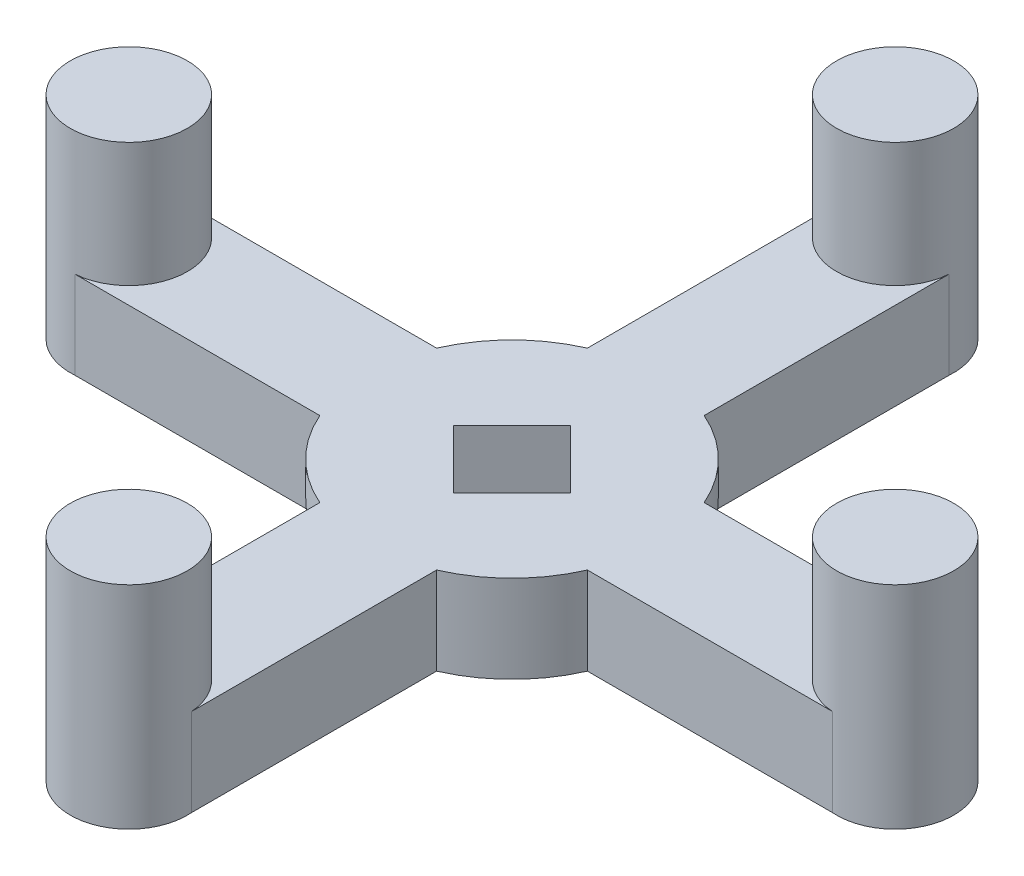
ISO-10303-21;
HEADER;
FILE_DESCRIPTION(('STEP AP214'),'2;1');
FILE_NAME('part.step','',(''),(''),'','','');
FILE_SCHEMA(('AUTOMOTIVE_DESIGN { 1 0 10303 214 1 1 1 1 }'));
ENDSEC;
DATA;
#1=APPLICATION_CONTEXT('core data for automotive mechanical design processes');
#2=APPLICATION_PROTOCOL_DEFINITION('international standard','automotive_design',2000,#1);
#3=PRODUCT_CONTEXT('',#1,'mechanical');
#4=PRODUCT('Part','Part','',(#3));
#5=PRODUCT_RELATED_PRODUCT_CATEGORY('part','',(#4));
#6=PRODUCT_DEFINITION_FORMATION('','',#4);
#7=PRODUCT_DEFINITION_CONTEXT('part definition',#1,'design');
#8=PRODUCT_DEFINITION('design','',#6,#7);
#9=PRODUCT_DEFINITION_SHAPE('','',#8);
#10=(LENGTH_UNIT() NAMED_UNIT(*) SI_UNIT(.MILLI.,.METRE.));
#11=(NAMED_UNIT(*) PLANE_ANGLE_UNIT() SI_UNIT($,.RADIAN.));
#12=(NAMED_UNIT(*) SI_UNIT($,.STERADIAN.) SOLID_ANGLE_UNIT());
#13=UNCERTAINTY_MEASURE_WITH_UNIT(LENGTH_MEASURE(1.E-05),#10,'distance_accuracy_value','');
#14=(GEOMETRIC_REPRESENTATION_CONTEXT(3) GLOBAL_UNCERTAINTY_ASSIGNED_CONTEXT((#13)) GLOBAL_UNIT_ASSIGNED_CONTEXT((#10,
#11,#12)) REPRESENTATION_CONTEXT('',''));
#15=CARTESIAN_POINT('',(0.,0.,0.));
#16=DIRECTION('',(0.,0.,1.));
#17=DIRECTION('',(1.,0.,0.));
#18=AXIS2_PLACEMENT_3D('',#15,#16,#17);
#19=CARTESIAN_POINT('',(-30.2617295595949,0.,30.261729559595));
#20=DIRECTION('',(0.707106781186547,0.,-0.707106781186548));
#21=DIRECTION('',(-0.707106781186548,0.,-0.707106781186547));
#22=AXIS2_PLACEMENT_3D('',#19,#20,#21);
#23=CYLINDRICAL_SURFACE('',#22,1.05);
#24=CARTESIAN_POINT('',(-2.00005153058616,0.,2.00005153058615));
#25=DIRECTION('',(-0.707106781186551,0.,0.707106781186544));
#26=DIRECTION('',(0.707106781186544,0.,0.707106781186551));
#27=AXIS2_PLACEMENT_3D('',#24,#25,#26);
#28=CIRCLE('',#27,1.05);
#29=CARTESIAN_POINT('',(-1.25758941034029,0.,2.74251365083203));
#30=VERTEX_POINT('',#29);
#31=EDGE_CURVE('E164',#30,#30,#28,.F.);
#32=ORIENTED_EDGE('',*,*,#31,.T.);
#33=EDGE_LOOP('',(#32));
#34=FACE_BOUND('',#33,.T.);
#35=CARTESIAN_POINT('',(-7.77444263785257,0.,6.28951839736082));
#36=CARTESIAN_POINT('',(-7.7744413524949,0.0588042797988381,6.28952070320949));
#37=CARTESIAN_POINT('',(-7.77131060427181,0.117647053856749,6.29339600114819));
#38=CARTESIAN_POINT('',(-7.75883832687858,0.233700042419567,6.30876548813307));
#39=CARTESIAN_POINT('',(-7.74949001778663,0.29090840358077,6.32026799420556));
#40=CARTESIAN_POINT('',(-7.72476692201935,0.401995206222953,6.35046095734337));
#41=CARTESIAN_POINT('',(-7.70939586833665,0.45587568647583,6.36914696182735));
#42=CARTESIAN_POINT('',(-7.67293150099148,0.558818620858889,6.41302831098017));
#43=CARTESIAN_POINT('',(-7.65183929481719,0.607882004971089,6.43822239578411));
#44=CARTESIAN_POINT('',(-7.60426843265572,0.700005301180209,6.49434026583252));
#45=CARTESIAN_POINT('',(-7.57777089534291,0.7430432520097,6.52528410076258));
#46=CARTESIAN_POINT('',(-7.51999053110413,0.821704767158425,6.59178874010345));
#47=CARTESIAN_POINT('',(-7.48870748195267,0.857327986977329,6.62734975891146));
#48=CARTESIAN_POINT('',(-7.42197396455896,0.92022535491958,6.70200051768648));
#49=CARTESIAN_POINT('',(-7.38651401074842,0.947479972078869,6.74109824078517));
#50=CARTESIAN_POINT('',(-7.31233413428337,0.992741502827463,6.82149233808943));
#51=CARTESIAN_POINT('',(-7.27361429866437,1.01074866322335,6.862788653584));
#52=CARTESIAN_POINT('',(-7.19405843241905,1.03693945360646,6.94613765531224));
#53=CARTESIAN_POINT('',(-7.15323077908548,1.04515925388732,6.98818696998152));
#54=CARTESIAN_POINT('',(-7.07044375033903,1.05165394447468,7.07193688726315));
#55=CARTESIAN_POINT('',(-7.02848440707793,1.0499291170166,7.11363749973827));
#56=CARTESIAN_POINT('',(-6.94481171294699,1.03661280659589,7.19534553837829));
#57=CARTESIAN_POINT('',(-6.90309804417206,1.02506021859492,7.23535898746464));
#58=CARTESIAN_POINT('',(-6.82100013058422,0.99247695381716,7.31280685191605));
#59=CARTESIAN_POINT('',(-6.78061590455517,0.971446143183014,7.35024123084928));
#60=CARTESIAN_POINT('',(-6.70235585094182,0.920461009383729,7.42167376563218));
#61=CARTESIAN_POINT('',(-6.66448501443044,0.890489544046534,7.45566515088902));
#62=CARTESIAN_POINT('',(-6.59255339760426,0.822486331471132,7.51934511767296));
#63=CARTESIAN_POINT('',(-6.558492740612,0.784454323455863,7.54903355993762));
#64=CARTESIAN_POINT('',(-6.49515786090781,0.701191031075323,7.60359677451168));
#65=CARTESIAN_POINT('',(-6.46590752248891,0.65592589989252,7.62844763289442));
#66=CARTESIAN_POINT('',(-6.41340473073608,0.559598424337302,7.67264108284968));
#67=CARTESIAN_POINT('',(-6.39015228763259,0.508536070076924,7.69198366502689));
#68=CARTESIAN_POINT('',(-6.35047090181121,0.402036893214183,7.7247773678977));
#69=CARTESIAN_POINT('',(-6.33404362923858,0.346599003846314,7.73822704661923));
#70=CARTESIAN_POINT('',(-6.30862686086858,0.232935780615798,7.75896246903904));
#71=CARTESIAN_POINT('',(-6.29963711469647,0.174710540655529,7.76624842023146));
#72=CARTESIAN_POINT('',(-6.28945751956443,0.057422457182683,7.7744946856462));
#73=CARTESIAN_POINT('',(-6.28823070639442,-0.00163507280433432,7.77548497757072));
#74=CARTESIAN_POINT('',(-6.2935246359548,-0.119171980098777,7.77120060205943));
#75=CARTESIAN_POINT('',(-6.30004526305909,-0.177651366021537,7.76592602812315));
#76=CARTESIAN_POINT('',(-6.32056524649243,-0.292233290204495,7.74923398963824));
#77=CARTESIAN_POINT('',(-6.33454714797061,-0.348341047362894,7.73783086174169));
#78=CARTESIAN_POINT('',(-6.36946658816452,-0.45674943530397,7.70911171588037));
#79=CARTESIAN_POINT('',(-6.39040430197649,-0.509049970208356,7.69179554906843));
#80=CARTESIAN_POINT('',(-6.43858039930818,-0.608574758075075,7.65151411736756));
#81=CARTESIAN_POINT('',(-6.46584211695633,-0.655779238565999,7.6285279109229));
#82=CARTESIAN_POINT('',(-6.52567663847168,-0.743571223762096,7.577406471072));
#83=CARTESIAN_POINT('',(-6.55824958740715,-0.784158547669061,7.54927109702146));
#84=CARTESIAN_POINT('',(-6.62775089741038,-0.857727885414378,7.48832815337124));
#85=CARTESIAN_POINT('',(-6.66469608147575,-0.890678978632526,7.45550242930256));
#86=CARTESIAN_POINT('',(-6.74162364087402,-0.947827506723883,7.38601337951569));
#87=CARTESIAN_POINT('',(-6.78160597089742,-0.972025072155117,7.34935011104461));
#88=CARTESIAN_POINT('',(-6.86325434886092,-1.01092751437801,7.27315948466202));
#89=CARTESIAN_POINT('',(-6.90491694014335,-1.02565091906968,7.23363788607238));
#90=CARTESIAN_POINT('',(-6.98871980633584,-1.04524753160562,7.15270487215369));
#91=CARTESIAN_POINT('',(-7.03086006630537,-1.0501210466847,7.1112935158106));
#92=CARTESIAN_POINT('',(-7.11417679631512,-1.04987496317388,7.0279402764482));
#93=CARTESIAN_POINT('',(-7.1553569264872,-1.04480330559072,6.98600190213463));
#94=CARTESIAN_POINT('',(-7.23582330825925,-1.02491155583418,6.90262407206424));
#95=CARTESIAN_POINT('',(-7.27510955880731,-1.01009145824638,6.86118461658454));
#96=CARTESIAN_POINT('',(-7.35076196654905,-0.971137135914569,6.78007200159183));
#97=CARTESIAN_POINT('',(-7.38712861502157,-0.947004482171252,6.74039854541836));
#98=CARTESIAN_POINT('',(-7.45607069046568,-0.890115142024079,6.66405722045093));
#99=CARTESIAN_POINT('',(-7.48864612714241,-0.857358477697597,6.62738934396304));
#100=CARTESIAN_POINT('',(-7.54941396202652,-0.783971522019472,6.55808557486453));
#101=CARTESIAN_POINT('',(-7.57758539202058,-0.743305516068438,6.52546911438952));
#102=CARTESIAN_POINT('',(-7.6287676057711,-0.655325701716674,6.46555965584064));
#103=CARTESIAN_POINT('',(-7.65177715284184,-0.608010304659201,6.43826793367308));
#104=CARTESIAN_POINT('',(-7.69221391360084,-0.507929430287261,6.38990177906103));
#105=CARTESIAN_POINT('',(-7.70962545717051,-0.455149191581643,6.36884481193997));
#106=CARTESIAN_POINT('',(-7.73841714659912,-0.345776118684258,6.33383127343739));
#107=CARTESIAN_POINT('',(-7.74980405166929,-0.289187637789121,6.31986674555692));
#108=CARTESIAN_POINT('',(-7.76351730688003,-0.193569603323703,6.30300476187987));
#109=CARTESIAN_POINT('',(-7.76761028450322,-0.155149989320419,6.2979559817554));
#110=CARTESIAN_POINT('',(-7.77307336889279,-0.0778258699252754,6.29121204437081));
#111=CARTESIAN_POINT('',(-7.77444348860489,-0.0389213668396894,6.28951687116609));
#112=CARTESIAN_POINT('',(-7.77444263785257,0.,6.28951839736082));
#113=B_SPLINE_CURVE_WITH_KNOTS('',3,(#35,#36,#37,#38,#39,#40,#41,#42,#43,#44,#45,#46,#47,#48,
#49,#50,#51,#52,#53,#54,#55,#56,#57,#58,#59,#60,#61,#62,#63,#64,#65,#66,#67,#68,#69,#70,#71,#72,
#73,#74,#75,#76,#77,#78,#79,#80,#81,#82,#83,#84,#85,#86,#87,#88,#89,#90,#91,#92,#93,#94,#95,#96,
#97,#98,#99,#100,#101,#102,#103,#104,#105,#106,#107,#108,#109,#110,#111,#112),.UNSPECIFIED.,.T.,
.F.,(4,2,2,2,2,2,2,2,2,2,2,2,2,2,2,2,2,2,2,2,2,2,2,2,2,2,2,2,2,2,2,2,2,2,2,2,2,2,4),(0.,
0.1762706963785,0.352733922474548,0.529087946442197,0.705407856516878,0.882354552232955,
1.05930946734291,1.23667428145322,1.41403436160476,1.59073693283144,1.76743448914147,
1.94343597219078,2.11943994092054,2.29578356009889,2.4721328852693,2.64933298541188,
2.82653338779815,3.00377712629631,3.18101489786945,3.35740808978209,3.5337986491606,
3.70977835919644,3.8857624994441,4.06240661039893,4.23905554692919,4.4164077370964,
4.59375728196371,4.77075893511106,4.94775506719057,5.12390008127571,5.30004519319432,
5.47616060293431,5.65227556182515,5.82920504681592,6.00617687547238,6.18363986156144,
6.36090332246534,6.47757389609535,6.59424391501752),.UNSPECIFIED.);
#114=CARTESIAN_POINT('',(-7.77444263785257,0.,6.28951839736082));
#115=VERTEX_POINT('',#114);
#116=EDGE_CURVE('E336',#115,#115,#113,.T.);
#117=ORIENTED_EDGE('',*,*,#116,.F.);
#118=EDGE_LOOP('',(#117));
#119=FACE_BOUND('',#118,.T.);
#120=ADVANCED_FACE('F160',(#34,#119),#23,.F.);
#121=CARTESIAN_POINT('',(0.,3.,0.));
#122=DIRECTION('',(0.,-1.,0.));
#123=DIRECTION('',(0.,0.,-1.));
#124=AXIS2_PLACEMENT_3D('',#121,#122,#123);
#125=CYLINDRICAL_SURFACE('',#124,10.);
#126=CARTESIAN_POINT('',(0.,3.,0.));
#127=DIRECTION('',(0.,1.,0.));
#128=DIRECTION('',(0.,0.,1.));
#129=AXIS2_PLACEMENT_3D('',#126,#127,#128);
#130=CIRCLE('',#129,10.);
#131=CARTESIAN_POINT('',(-4.,3.,-9.16515138991168));
#132=VERTEX_POINT('',#131);
#133=CARTESIAN_POINT('',(-9.16515138991168,3.,-4.));
#134=VERTEX_POINT('',#133);
#135=EDGE_CURVE('E454',#132,#134,#130,.T.);
#136=ORIENTED_EDGE('',*,*,#135,.F.);
#137=DIRECTION('',(0.,1.,0.));
#138=VECTOR('',#137,1.);
#139=CARTESIAN_POINT('',(-4.,-3.,-9.16515138991168));
#140=LINE('',#139,#138);
#141=CARTESIAN_POINT('',(-4.,-3.,-9.16515138991168));
#142=VERTEX_POINT('',#141);
#143=EDGE_CURVE('E12',#142,#132,#140,.T.);
#144=ORIENTED_EDGE('',*,*,#143,.F.);
#145=CARTESIAN_POINT('',(0.,-3.,0.));
#146=DIRECTION('',(0.,1.,0.));
#147=DIRECTION('',(0.,0.,1.));
#148=AXIS2_PLACEMENT_3D('',#145,#146,#147);
#149=CIRCLE('',#148,10.);
#150=CARTESIAN_POINT('',(-9.16515138991168,-3.,-4.));
#151=VERTEX_POINT('',#150);
#152=EDGE_CURVE('E429',#142,#151,#149,.T.);
#153=ORIENTED_EDGE('',*,*,#152,.T.);
#154=DIRECTION('',(0.,-1.,0.));
#155=VECTOR('',#154,1.);
#156=CARTESIAN_POINT('',(-9.16515138991168,3.,-4.));
#157=LINE('',#156,#155);
#158=EDGE_CURVE('E489',#134,#151,#157,.T.);
#159=ORIENTED_EDGE('',*,*,#158,.F.);
#160=EDGE_LOOP('',(#136,#144,#153,#159));
#161=FACE_BOUND('',#160,.T.);
#162=ADVANCED_FACE('F384',(#161),#125,.T.);
#163=CARTESIAN_POINT('',(0.,3.,0.));
#164=DIRECTION('',(0.,1.,0.));
#165=DIRECTION('',(0.,0.,1.));
#166=AXIS2_PLACEMENT_3D('',#163,#164,#165);
#167=PLANE('',#166);
#168=DIRECTION('',(0.707106781186544,0.,0.707106781186551));
#169=VECTOR('',#168,1.);
#170=CARTESIAN_POINT('',(-2.00005153058616,3.,2.00005153058614));
#171=LINE('',#170,#169);
#172=CARTESIAN_POINT('',(-4.0001030611723,3.,0.));
#173=VERTEX_POINT('',#172);
#174=CARTESIAN_POINT('',(0.,3.,4.0001030611723));
#175=VERTEX_POINT('',#174);
#176=EDGE_CURVE('E305',#173,#175,#171,.T.);
#177=ORIENTED_EDGE('',*,*,#176,.F.);
#178=DIRECTION('',(-0.707106781186552,0.,0.707106781186543));
#179=VECTOR('',#178,1.);
#180=CARTESIAN_POINT('',(-2.00005153058614,3.,-2.00005153058616));
#181=LINE('',#180,#179);
#182=CARTESIAN_POINT('',(0.,3.,-4.0001030611723));
#183=VERTEX_POINT('',#182);
#184=EDGE_CURVE('E334',#183,#173,#181,.T.);
#185=ORIENTED_EDGE('',*,*,#184,.F.);
#186=DIRECTION('',(-0.707106781186544,0.,-0.707106781186551));
#187=VECTOR('',#186,1.);
#188=CARTESIAN_POINT('',(2.00005153058616,3.,-2.00005153058614));
#189=LINE('',#188,#187);
#190=CARTESIAN_POINT('',(4.0001030611723,3.,0.));
#191=VERTEX_POINT('',#190);
#192=EDGE_CURVE('E329',#191,#183,#189,.T.);
#193=ORIENTED_EDGE('',*,*,#192,.F.);
#194=DIRECTION('',(0.707106781186551,0.,-0.707106781186544));
#195=VECTOR('',#194,1.);
#196=CARTESIAN_POINT('',(2.00005153058614,3.,2.00005153058616));
#197=LINE('',#196,#195);
#198=EDGE_CURVE('E332',#175,#191,#197,.T.);
#199=ORIENTED_EDGE('',*,*,#198,.F.);
#200=EDGE_LOOP('',(#177,#185,#193,#199));
#201=FACE_BOUND('',#200,.T.);
#202=CARTESIAN_POINT('',(26.25,3.,-2.73346806510016E-13));
#203=DIRECTION('',(0.,1.,0.));
#204=DIRECTION('',(0.,0.,1.));
#205=AXIS2_PLACEMENT_3D('',#202,#203,#204);
#206=CIRCLE('',#205,4.01172955959494);
#207=CARTESIAN_POINT('',(25.9434481131521,3.,-4.));
#208=VERTEX_POINT('',#207);
#209=CARTESIAN_POINT('',(25.9434481131557,3.,3.99999999999972));
#210=VERTEX_POINT('',#209);
#211=EDGE_CURVE('E581',#208,#210,#206,.T.);
#212=ORIENTED_EDGE('',*,*,#211,.F.);
#213=DIRECTION('',(-1.,0.,0.));
#214=VECTOR('',#213,1.);
#215=CARTESIAN_POINT('',(0.,3.,-4.));
#216=LINE('',#215,#214);
#217=CARTESIAN_POINT('',(9.16515138991168,3.,-4.));
#218=VERTEX_POINT('',#217);
#219=EDGE_CURVE('E457',#208,#218,#216,.T.);
#220=ORIENTED_EDGE('',*,*,#219,.T.);
#221=CARTESIAN_POINT('',(4.,3.,-9.16515138991168));
#222=VERTEX_POINT('',#221);
#223=EDGE_CURVE('E450',#218,#222,#130,.T.);
#224=ORIENTED_EDGE('',*,*,#223,.T.);
#225=DIRECTION('',(0.,0.,-1.));
#226=VECTOR('',#225,1.);
#227=CARTESIAN_POINT('',(4.,3.,0.));
#228=LINE('',#227,#226);
#229=CARTESIAN_POINT('',(4.,3.,-25.9434481131557));
#230=VERTEX_POINT('',#229);
#231=EDGE_CURVE('E492',#222,#230,#228,.T.);
#232=ORIENTED_EDGE('',*,*,#231,.T.);
#233=CARTESIAN_POINT('',(0.,3.,-26.25));
#234=DIRECTION('',(0.,1.,0.));
#235=DIRECTION('',(0.,0.,1.));
#236=AXIS2_PLACEMENT_3D('',#233,#234,#235);
#237=CIRCLE('',#236,4.01172955959494);
#238=CARTESIAN_POINT('',(-3.99999999999999,3.,-25.9434481131557));
#239=VERTEX_POINT('',#238);
#240=EDGE_CURVE('E434',#239,#230,#237,.T.);
#241=ORIENTED_EDGE('',*,*,#240,.F.);
#242=DIRECTION('',(0.,0.,-1.));
#243=VECTOR('',#242,1.);
#244=CARTESIAN_POINT('',(-4.,3.,0.));
#245=LINE('',#244,#243);
#246=EDGE_CURVE('E495',#132,#239,#245,.T.);
#247=ORIENTED_EDGE('',*,*,#246,.F.);
#248=ORIENTED_EDGE('',*,*,#135,.T.);
#249=DIRECTION('',(-1.,0.,0.));
#250=VECTOR('',#249,1.);
#251=CARTESIAN_POINT('',(0.,3.,-4.));
#252=LINE('',#251,#250);
#253=CARTESIAN_POINT('',(-25.9434481131557,3.,-3.9999999999999));
#254=VERTEX_POINT('',#253);
#255=EDGE_CURVE('E482',#134,#254,#252,.T.);
#256=ORIENTED_EDGE('',*,*,#255,.T.);
#257=CARTESIAN_POINT('',(-26.25,3.,0.));
#258=DIRECTION('',(0.,1.,0.));
#259=DIRECTION('',(0.,0.,1.));
#260=AXIS2_PLACEMENT_3D('',#257,#258,#259);
#261=CIRCLE('',#260,4.01172955959494);
#262=CARTESIAN_POINT('',(-25.9434481131545,3.,4.));
#263=VERTEX_POINT('',#262);
#264=EDGE_CURVE('E565',#263,#254,#261,.T.);
#265=ORIENTED_EDGE('',*,*,#264,.F.);
#266=DIRECTION('',(-1.,0.,0.));
#267=VECTOR('',#266,1.);
#268=CARTESIAN_POINT('',(0.,3.,4.));
#269=LINE('',#268,#267);
#270=CARTESIAN_POINT('',(-9.16515138991168,3.,4.));
#271=VERTEX_POINT('',#270);
#272=EDGE_CURVE('E415',#271,#263,#269,.T.);
#273=ORIENTED_EDGE('',*,*,#272,.F.);
#274=CARTESIAN_POINT('',(-4.,3.,9.16515138991168));
#275=VERTEX_POINT('',#274);
#276=EDGE_CURVE('E410',#271,#275,#130,.T.);
#277=ORIENTED_EDGE('',*,*,#276,.T.);
#278=DIRECTION('',(0.,0.,-1.));
#279=VECTOR('',#278,1.);
#280=CARTESIAN_POINT('',(-4.,3.,0.));
#281=LINE('',#280,#279);
#282=CARTESIAN_POINT('',(-4.,3.,25.9434481131557));
#283=VERTEX_POINT('',#282);
#284=EDGE_CURVE('E468',#283,#275,#281,.T.);
#285=ORIENTED_EDGE('',*,*,#284,.F.);
#286=CARTESIAN_POINT('',(0.,3.,26.25));
#287=DIRECTION('',(0.,1.,0.));
#288=DIRECTION('',(0.,0.,1.));
#289=AXIS2_PLACEMENT_3D('',#286,#287,#288);
#290=CIRCLE('',#289,4.01172955959494);
#291=CARTESIAN_POINT('',(4.,3.,25.9434481131556));
#292=VERTEX_POINT('',#291);
#293=EDGE_CURVE('E574',#292,#283,#290,.T.);
#294=ORIENTED_EDGE('',*,*,#293,.F.);
#295=DIRECTION('',(0.,0.,-1.));
#296=VECTOR('',#295,1.);
#297=CARTESIAN_POINT('',(4.,3.,0.));
#298=LINE('',#297,#296);
#299=CARTESIAN_POINT('',(4.,3.,9.16515138991168));
#300=VERTEX_POINT('',#299);
#301=EDGE_CURVE('E471',#292,#300,#298,.T.);
#302=ORIENTED_EDGE('',*,*,#301,.T.);
#303=CARTESIAN_POINT('',(9.16515138991168,3.,4.));
#304=VERTEX_POINT('',#303);
#305=EDGE_CURVE('E422',#300,#304,#130,.T.);
#306=ORIENTED_EDGE('',*,*,#305,.T.);
#307=DIRECTION('',(-1.,0.,0.));
#308=VECTOR('',#307,1.);
#309=CARTESIAN_POINT('',(0.,3.,4.));
#310=LINE('',#309,#308);
#311=EDGE_CURVE('E453',#210,#304,#310,.T.);
#312=ORIENTED_EDGE('',*,*,#311,.F.);
#313=EDGE_LOOP('',(#212,#220,#224,#232,#241,#247,#248,#256,#265,#273,#277,#285,#294,#302,#306,#312));
#314=FACE_BOUND('',#313,.T.);
#315=ADVANCED_FACE('F389',(#201,#314),#167,.T.);
#316=CARTESIAN_POINT('',(6.2895183973608,0.,-7.77444263785256));
#317=CARTESIAN_POINT('',(6.28952070320947,-0.0588042797988384,-7.77444135249488));
#318=CARTESIAN_POINT('',(6.29339600114818,-0.117647053856749,-7.77131060427181));
#319=CARTESIAN_POINT('',(6.30876548813306,-0.233700042419568,-7.75883832687859));
#320=CARTESIAN_POINT('',(6.32026799420555,-0.290908403580771,-7.74949001778663));
#321=CARTESIAN_POINT('',(6.35046095734337,-0.401995206222953,-7.72476692201934));
#322=CARTESIAN_POINT('',(6.36914696182735,-0.455875686475829,-7.70939586833665));
#323=CARTESIAN_POINT('',(6.41302831098017,-0.558818620858889,-7.67293150099148));
#324=CARTESIAN_POINT('',(6.43822239578411,-0.607882004971091,-7.65183929481719));
#325=CARTESIAN_POINT('',(6.49434026583252,-0.700005301180212,-7.60426843265572));
#326=CARTESIAN_POINT('',(6.52528410076258,-0.743043252009701,-7.57777089534292));
#327=CARTESIAN_POINT('',(6.59178874010345,-0.821704767158423,-7.51999053110413));
#328=CARTESIAN_POINT('',(6.62734975891146,-0.857327986977326,-7.48870748195267));
#329=CARTESIAN_POINT('',(6.70200051768648,-0.920225354919579,-7.42197396455896));
#330=CARTESIAN_POINT('',(6.74109824078517,-0.947479972078871,-7.38651401074842));
#331=CARTESIAN_POINT('',(6.82149233808943,-0.992741502827465,-7.31233413428337));
#332=CARTESIAN_POINT('',(6.862788653584,-1.01074866322335,-7.27361429866437));
#333=CARTESIAN_POINT('',(6.94613765531224,-1.03693945360646,-7.19405843241906));
#334=CARTESIAN_POINT('',(6.98818696998152,-1.04515925388732,-7.15323077908549));
#335=CARTESIAN_POINT('',(7.07193688726315,-1.05165394447468,-7.07044375033903));
#336=CARTESIAN_POINT('',(7.11363749973827,-1.04992911701659,-7.02848440707793));
#337=CARTESIAN_POINT('',(7.19534553837829,-1.03661280659589,-6.94481171294699));
#338=CARTESIAN_POINT('',(7.23535898746464,-1.02506021859491,-6.90309804417206));
#339=CARTESIAN_POINT('',(7.31280685191605,-0.992476953817158,-6.82100013058422));
#340=CARTESIAN_POINT('',(7.35024123084928,-0.971446143183011,-6.78061590455517));
#341=CARTESIAN_POINT('',(7.42167376563218,-0.920461009383726,-6.70235585094182));
#342=CARTESIAN_POINT('',(7.45566515088902,-0.890489544046533,-6.66448501443044));
#343=CARTESIAN_POINT('',(7.51934511767296,-0.822486331471132,-6.59255339760426));
#344=CARTESIAN_POINT('',(7.54903355993762,-0.784454323455861,-6.558492740612));
#345=CARTESIAN_POINT('',(7.60359677451168,-0.701191031075321,-6.49515786090781));
#346=CARTESIAN_POINT('',(7.62844763289442,-0.655925899892519,-6.46590752248891));
#347=CARTESIAN_POINT('',(7.67264108284968,-0.559598424337299,-6.41340473073608));
#348=CARTESIAN_POINT('',(7.69198366502689,-0.508536070076919,-6.3901522876326));
#349=CARTESIAN_POINT('',(7.7247773678977,-0.402036893214177,-6.35047090181122));
#350=CARTESIAN_POINT('',(7.73822704661923,-0.34659900384631,-6.33404362923858));
#351=CARTESIAN_POINT('',(7.75896246903904,-0.232935780615794,-6.30862686086858));
#352=CARTESIAN_POINT('',(7.76624842023146,-0.174710540655524,-6.29963711469647));
#353=CARTESIAN_POINT('',(7.7744946856462,-0.0574224571826775,-6.28945751956443));
#354=CARTESIAN_POINT('',(7.77548497757072,0.00163507280433882,-6.28823070639442));
#355=CARTESIAN_POINT('',(7.77120060205943,0.11917198009878,-6.2935246359548));
#356=CARTESIAN_POINT('',(7.76592602812315,0.17765136602154,-6.30004526305909));
#357=CARTESIAN_POINT('',(7.74923398963824,0.292233290204497,-6.32056524649243));
#358=CARTESIAN_POINT('',(7.73783086174169,0.348341047362895,-6.33454714797061));
#359=CARTESIAN_POINT('',(7.70911171588037,0.456749435303972,-6.36946658816452));
#360=CARTESIAN_POINT('',(7.69179554906843,0.509049970208358,-6.39040430197649));
#361=CARTESIAN_POINT('',(7.65151411736756,0.608574758075079,-6.43858039930818));
#362=CARTESIAN_POINT('',(7.6285279109229,0.655779238566003,-6.46584211695633));
#363=CARTESIAN_POINT('',(7.577406471072,0.743571223762098,-6.52567663847169));
#364=CARTESIAN_POINT('',(7.54927109702145,0.78415854766906,-6.55824958740715));
#365=CARTESIAN_POINT('',(7.48832815337123,0.857727885414377,-6.62775089741039));
#366=CARTESIAN_POINT('',(7.45550242930255,0.890678978632527,-6.66469608147576));
#367=CARTESIAN_POINT('',(7.38601337951568,0.947827506723883,-6.74162364087402));
#368=CARTESIAN_POINT('',(7.34935011104461,0.972025072155115,-6.78160597089743));
#369=CARTESIAN_POINT('',(7.27315948466202,1.01092751437801,-6.86325434886092));
#370=CARTESIAN_POINT('',(7.23363788607238,1.02565091906968,-6.90491694014335));
#371=CARTESIAN_POINT('',(7.15270487215369,1.04524753160562,-6.98871980633584));
#372=CARTESIAN_POINT('',(7.1112935158106,1.0501210466847,-7.03086006630538));
#373=CARTESIAN_POINT('',(7.0279402764482,1.04987496317388,-7.11417679631512));
#374=CARTESIAN_POINT('',(6.98600190213463,1.04480330559072,-7.1553569264872));
#375=CARTESIAN_POINT('',(6.90262407206424,1.02491155583418,-7.23582330825925));
#376=CARTESIAN_POINT('',(6.86118461658453,1.01009145824638,-7.27510955880732));
#377=CARTESIAN_POINT('',(6.78007200159182,0.971137135914566,-7.35076196654905));
#378=CARTESIAN_POINT('',(6.74039854541835,0.947004482171249,-7.38712861502158));
#379=CARTESIAN_POINT('',(6.66405722045093,0.890115142024075,-7.45607069046568));
#380=CARTESIAN_POINT('',(6.62738934396304,0.857358477697592,-7.48864612714241));
#381=CARTESIAN_POINT('',(6.55808557486453,0.783971522019465,-7.54941396202652));
#382=CARTESIAN_POINT('',(6.52546911438951,0.743305516068432,-7.57758539202058));
#383=CARTESIAN_POINT('',(6.46555965584064,0.655325701716669,-7.6287676057711));
#384=CARTESIAN_POINT('',(6.43826793367307,0.608010304659197,-7.65177715284185));
#385=CARTESIAN_POINT('',(6.38990177906102,0.507929430287259,-7.69221391360084));
#386=CARTESIAN_POINT('',(6.36884481193997,0.455149191581643,-7.70962545717052));
#387=CARTESIAN_POINT('',(6.33383127343739,0.345776118684255,-7.73841714659912));
#388=CARTESIAN_POINT('',(6.31986674555692,0.289187637789115,-7.74980405166928));
#389=CARTESIAN_POINT('',(6.30300476187987,0.193569603323696,-7.76351730688003));
#390=CARTESIAN_POINT('',(6.29795598175539,0.155149989320415,-7.76761028450324));
#391=CARTESIAN_POINT('',(6.2912120443708,0.0778258699252737,-7.77307336889279));
#392=CARTESIAN_POINT('',(6.28951687116607,0.0389213668396885,-7.77444348860488));
#393=CARTESIAN_POINT('',(6.2895183973608,0.,-7.77444263785256));
#394=B_SPLINE_CURVE_WITH_KNOTS('',3,(#316,#317,#318,#319,#320,#321,#322,#323,#324,#325,#326,
#327,#328,#329,#330,#331,#332,#333,#334,#335,#336,#337,#338,#339,#340,#341,#342,#343,#344,#345,
#346,#347,#348,#349,#350,#351,#352,#353,#354,#355,#356,#357,#358,#359,#360,#361,#362,#363,#364,
#365,#366,#367,#368,#369,#370,#371,#372,#373,#374,#375,#376,#377,#378,#379,#380,#381,#382,#383,
#384,#385,#386,#387,#388,#389,#390,#391,#392,#393),.UNSPECIFIED.,.T.,.F.,(4,2,2,2,2,2,2,2,2,2,2,
2,2,2,2,2,2,2,2,2,2,2,2,2,2,2,2,2,2,2,2,2,2,2,2,2,2,2,4),(0.,0.1762706963785,0.352733922474549,
0.529087946442199,0.705407856516879,0.882354552232957,1.05930946734292,1.23667428145322,
1.41403436160476,1.59073693283144,1.76743448914148,1.94343597219078,2.11943994092055,
2.2957835600989,2.47213288526931,2.64933298541188,2.82653338779816,3.00377712629631,
3.18101489786945,3.35740808978209,3.5337986491606,3.70977835919645,3.8857624994441,
4.06240661039893,4.23905554692919,4.41640773709641,4.5937572819637,4.77075893511106,
4.94775506719057,5.12390008127571,5.30004519319432,5.47616060293432,5.65227556182515,
5.82920504681592,6.00617687547238,6.18363986156144,6.36090332246534,6.47757389609535,
6.59424391501752),.UNSPECIFIED.);
#395=CARTESIAN_POINT('',(6.2895183973608,0.,-7.77444263785256));
#396=VERTEX_POINT('',#395);
#397=EDGE_CURVE('E337',#396,#396,#394,.T.);
#398=ORIENTED_EDGE('',*,*,#397,.T.);
#399=EDGE_LOOP('',(#398));
#400=FACE_BOUND('',#399,.T.);
#401=DIRECTION('',(0.,1.,0.));
#402=VECTOR('',#401,1.);
#403=CARTESIAN_POINT('',(4.,-3.,-9.16515138991168));
#404=LINE('',#403,#402);
#405=CARTESIAN_POINT('',(4.,-3.,-9.16515138991168));
#406=VERTEX_POINT('',#405);
#407=EDGE_CURVE('E367',#406,#222,#404,.T.);
#408=ORIENTED_EDGE('',*,*,#407,.T.);
#409=ORIENTED_EDGE('',*,*,#223,.F.);
#410=DIRECTION('',(0.,-1.,0.));
#411=VECTOR('',#410,1.);
#412=CARTESIAN_POINT('',(9.16515138991168,3.,-4.));
#413=LINE('',#412,#411);
#414=CARTESIAN_POINT('',(9.16515138991168,-3.,-4.));
#415=VERTEX_POINT('',#414);
#416=EDGE_CURVE('E459',#218,#415,#413,.T.);
#417=ORIENTED_EDGE('',*,*,#416,.T.);
#418=EDGE_CURVE('E432',#415,#406,#149,.T.);
#419=ORIENTED_EDGE('',*,*,#418,.T.);
#420=EDGE_LOOP('',(#408,#409,#417,#419));
#421=FACE_BOUND('',#420,.T.);
#422=ADVANCED_FACE('F391',(#400,#421),#125,.T.);
#423=CARTESIAN_POINT('',(0.,3.,-4.));
#424=DIRECTION('',(0.,0.,1.));
#425=DIRECTION('',(1.,0.,0.));
#426=AXIS2_PLACEMENT_3D('',#423,#424,#425);
#427=PLANE('',#426);
#428=ORIENTED_EDGE('',*,*,#158,.T.);
#429=DIRECTION('',(-1.,0.,0.));
#430=VECTOR('',#429,1.);
#431=CARTESIAN_POINT('',(0.,-3.,-4.));
#432=LINE('',#431,#430);
#433=CARTESIAN_POINT('',(-25.9434481131557,-3.,-3.99999999999991));
#434=VERTEX_POINT('',#433);
#435=EDGE_CURVE('E423',#151,#434,#432,.T.);
#436=ORIENTED_EDGE('',*,*,#435,.T.);
#437=DIRECTION('',(0.,-1.,0.));
#438=VECTOR('',#437,1.);
#439=CARTESIAN_POINT('',(-25.9434481131557,3.,-4.));
#440=LINE('',#439,#438);
#441=EDGE_CURVE('E487',#254,#434,#440,.T.);
#442=ORIENTED_EDGE('',*,*,#441,.F.);
#443=ORIENTED_EDGE('',*,*,#255,.F.);
#444=EDGE_LOOP('',(#428,#436,#442,#443));
#445=FACE_BOUND('',#444,.T.);
#446=ADVANCED_FACE('F532',(#445),#427,.F.);
#447=CARTESIAN_POINT('',(0.,3.,4.));
#448=DIRECTION('',(0.,0.,1.));
#449=DIRECTION('',(1.,0.,0.));
#450=AXIS2_PLACEMENT_3D('',#447,#448,#449);
#451=PLANE('',#450);
#452=DIRECTION('',(0.,-1.,0.));
#453=VECTOR('',#452,1.);
#454=CARTESIAN_POINT('',(-25.9434481131557,3.,4.));
#455=LINE('',#454,#453);
#456=CARTESIAN_POINT('',(-25.9434481131557,-3.,4.));
#457=VERTEX_POINT('',#456);
#458=EDGE_CURVE('E414',#263,#457,#455,.T.);
#459=ORIENTED_EDGE('',*,*,#458,.T.);
#460=DIRECTION('',(-1.,0.,0.));
#461=VECTOR('',#460,1.);
#462=CARTESIAN_POINT('',(0.,-3.,4.));
#463=LINE('',#462,#461);
#464=CARTESIAN_POINT('',(-9.16515138991168,-3.,4.));
#465=VERTEX_POINT('',#464);
#466=EDGE_CURVE('E419',#465,#457,#463,.T.);
#467=ORIENTED_EDGE('',*,*,#466,.F.);
#468=DIRECTION('',(0.,-1.,0.));
#469=VECTOR('',#468,1.);
#470=CARTESIAN_POINT('',(-9.16515138991168,3.,4.));
#471=LINE('',#470,#469);
#472=EDGE_CURVE('E404',#271,#465,#471,.T.);
#473=ORIENTED_EDGE('',*,*,#472,.F.);
#474=ORIENTED_EDGE('',*,*,#272,.T.);
#475=EDGE_LOOP('',(#459,#467,#473,#474));
#476=FACE_BOUND('',#475,.T.);
#477=ADVANCED_FACE('F420',(#476),#451,.T.);
#478=CARTESIAN_POINT('',(-4.,3.,0.));
#479=DIRECTION('',(-1.,0.,0.));
#480=DIRECTION('',(0.,0.,1.));
#481=AXIS2_PLACEMENT_3D('',#478,#479,#480);
#482=PLANE('',#481);
#483=DIRECTION('',(0.,-1.,0.));
#484=VECTOR('',#483,1.);
#485=CARTESIAN_POINT('',(-4.,3.,9.16515138991168));
#486=LINE('',#485,#484);
#487=CARTESIAN_POINT('',(-4.,-3.,9.16515138991168));
#488=VERTEX_POINT('',#487);
#489=EDGE_CURVE('E480',#275,#488,#486,.T.);
#490=ORIENTED_EDGE('',*,*,#489,.T.);
#491=DIRECTION('',(0.,0.,-1.));
#492=VECTOR('',#491,1.);
#493=CARTESIAN_POINT('',(-4.,-3.,0.));
#494=LINE('',#493,#492);
#495=CARTESIAN_POINT('',(-4.,-3.,25.9434481131556));
#496=VERTEX_POINT('',#495);
#497=EDGE_CURVE('E428',#496,#488,#494,.T.);
#498=ORIENTED_EDGE('',*,*,#497,.F.);
#499=DIRECTION('',(0.,-1.,0.));
#500=VECTOR('',#499,1.);
#501=CARTESIAN_POINT('',(-4.,3.,25.9434481131557));
#502=LINE('',#501,#500);
#503=EDGE_CURVE('E478',#283,#496,#502,.T.);
#504=ORIENTED_EDGE('',*,*,#503,.F.);
#505=ORIENTED_EDGE('',*,*,#284,.T.);
#506=EDGE_LOOP('',(#490,#498,#504,#505));
#507=FACE_BOUND('',#506,.T.);
#508=ADVANCED_FACE('F538',(#507),#482,.T.);
#509=CARTESIAN_POINT('',(4.,3.,0.));
#510=DIRECTION('',(-1.,0.,0.));
#511=DIRECTION('',(0.,0.,1.));
#512=AXIS2_PLACEMENT_3D('',#509,#510,#511);
#513=PLANE('',#512);
#514=DIRECTION('',(0.,-1.,0.));
#515=VECTOR('',#514,1.);
#516=CARTESIAN_POINT('',(4.,3.,25.9434481131557));
#517=LINE('',#516,#515);
#518=CARTESIAN_POINT('',(4.,-3.,25.9434481131557));
#519=VERTEX_POINT('',#518);
#520=EDGE_CURVE('E475',#292,#519,#517,.T.);
#521=ORIENTED_EDGE('',*,*,#520,.T.);
#522=DIRECTION('',(0.,0.,-1.));
#523=VECTOR('',#522,1.);
#524=CARTESIAN_POINT('',(4.,-3.,0.));
#525=LINE('',#524,#523);
#526=CARTESIAN_POINT('',(4.,-3.,9.16515138991168));
#527=VERTEX_POINT('',#526);
#528=EDGE_CURVE('E445',#519,#527,#525,.T.);
#529=ORIENTED_EDGE('',*,*,#528,.T.);
#530=DIRECTION('',(0.,-1.,0.));
#531=VECTOR('',#530,1.);
#532=CARTESIAN_POINT('',(4.,3.,9.16515138991168));
#533=LINE('',#532,#531);
#534=EDGE_CURVE('E473',#300,#527,#533,.T.);
#535=ORIENTED_EDGE('',*,*,#534,.F.);
#536=ORIENTED_EDGE('',*,*,#301,.F.);
#537=EDGE_LOOP('',(#521,#529,#535,#536));
#538=FACE_BOUND('',#537,.T.);
#539=ADVANCED_FACE('F541',(#538),#513,.F.);
#540=ORIENTED_EDGE('',*,*,#305,.F.);
#541=ORIENTED_EDGE('',*,*,#534,.T.);
#542=CARTESIAN_POINT('',(9.16515138991168,-3.,4.));
#543=VERTEX_POINT('',#542);
#544=EDGE_CURVE('E430',#527,#543,#149,.T.);
#545=ORIENTED_EDGE('',*,*,#544,.T.);
#546=DIRECTION('',(0.,-1.,0.));
#547=VECTOR('',#546,1.);
#548=CARTESIAN_POINT('',(9.16515138991168,3.,4.));
#549=LINE('',#548,#547);
#550=EDGE_CURVE('E466',#304,#543,#549,.T.);
#551=ORIENTED_EDGE('',*,*,#550,.F.);
#552=EDGE_LOOP('',(#540,#541,#545,#551));
#553=FACE_BOUND('',#552,.T.);
#554=ADVANCED_FACE('F401',(#553),#125,.T.);
#555=CARTESIAN_POINT('',(0.,3.,4.));
#556=DIRECTION('',(0.,0.,1.));
#557=DIRECTION('',(1.,0.,0.));
#558=AXIS2_PLACEMENT_3D('',#555,#556,#557);
#559=PLANE('',#558);
#560=ORIENTED_EDGE('',*,*,#550,.T.);
#561=DIRECTION('',(-1.,0.,0.));
#562=VECTOR('',#561,1.);
#563=CARTESIAN_POINT('',(0.,-3.,4.));
#564=LINE('',#563,#562);
#565=CARTESIAN_POINT('',(25.9434481131557,-3.,3.99999999999973));
#566=VERTEX_POINT('',#565);
#567=EDGE_CURVE('E437',#566,#543,#564,.T.);
#568=ORIENTED_EDGE('',*,*,#567,.F.);
#569=DIRECTION('',(0.,-1.,0.));
#570=VECTOR('',#569,1.);
#571=CARTESIAN_POINT('',(25.9434481131557,3.,4.));
#572=LINE('',#571,#570);
#573=EDGE_CURVE('E464',#210,#566,#572,.T.);
#574=ORIENTED_EDGE('',*,*,#573,.F.);
#575=ORIENTED_EDGE('',*,*,#311,.T.);
#576=EDGE_LOOP('',(#560,#568,#574,#575));
#577=FACE_BOUND('',#576,.T.);
#578=ADVANCED_FACE('F546',(#577),#559,.T.);
#579=CARTESIAN_POINT('',(0.,3.,-4.));
#580=DIRECTION('',(0.,0.,1.));
#581=DIRECTION('',(1.,0.,0.));
#582=AXIS2_PLACEMENT_3D('',#579,#580,#581);
#583=PLANE('',#582);
#584=DIRECTION('',(0.,-1.,0.));
#585=VECTOR('',#584,1.);
#586=CARTESIAN_POINT('',(25.9434481131557,3.,-4.));
#587=LINE('',#586,#585);
#588=CARTESIAN_POINT('',(25.9434481131557,-3.,-4.));
#589=VERTEX_POINT('',#588);
#590=EDGE_CURVE('E461',#208,#589,#587,.T.);
#591=ORIENTED_EDGE('',*,*,#590,.T.);
#592=DIRECTION('',(-1.,0.,0.));
#593=VECTOR('',#592,1.);
#594=CARTESIAN_POINT('',(0.,-3.,-4.));
#595=LINE('',#594,#593);
#596=EDGE_CURVE('E441',#589,#415,#595,.T.);
#597=ORIENTED_EDGE('',*,*,#596,.T.);
#598=ORIENTED_EDGE('',*,*,#416,.F.);
#599=ORIENTED_EDGE('',*,*,#219,.F.);
#600=EDGE_LOOP('',(#591,#597,#598,#599));
#601=FACE_BOUND('',#600,.T.);
#602=ADVANCED_FACE('F400',(#601),#583,.F.);
#603=ORIENTED_EDGE('',*,*,#116,.T.);
#604=EDGE_LOOP('',(#603));
#605=FACE_BOUND('',#604,.T.);
#606=ORIENTED_EDGE('',*,*,#472,.T.);
#607=EDGE_CURVE('E408',#465,#488,#149,.T.);
#608=ORIENTED_EDGE('',*,*,#607,.T.);
#609=ORIENTED_EDGE('',*,*,#489,.F.);
#610=ORIENTED_EDGE('',*,*,#276,.F.);
#611=EDGE_LOOP('',(#606,#608,#609,#610));
#612=FACE_BOUND('',#611,.T.);
#613=ADVANCED_FACE('F347',(#605,#612),#125,.T.);
#614=CARTESIAN_POINT('',(-4.,-3.,0.));
#615=DIRECTION('',(1.,0.,0.));
#616=DIRECTION('',(0.,0.,-1.));
#617=AXIS2_PLACEMENT_3D('',#614,#615,#616);
#618=PLANE('',#617);
#619=ORIENTED_EDGE('',*,*,#143,.T.);
#620=ORIENTED_EDGE('',*,*,#246,.T.);
#621=DIRECTION('',(0.,1.,0.));
#622=VECTOR('',#621,1.);
#623=CARTESIAN_POINT('',(-4.,-3.,-25.9434481131557));
#624=LINE('',#623,#622);
#625=CARTESIAN_POINT('',(-4.,-3.,-25.9434481131557));
#626=VERTEX_POINT('',#625);
#627=EDGE_CURVE('E169',#626,#239,#624,.T.);
#628=ORIENTED_EDGE('',*,*,#627,.F.);
#629=DIRECTION('',(0.,0.,-1.));
#630=VECTOR('',#629,1.);
#631=CARTESIAN_POINT('',(-4.,-3.,0.));
#632=LINE('',#631,#630);
#633=EDGE_CURVE('E501',#142,#626,#632,.T.);
#634=ORIENTED_EDGE('',*,*,#633,.F.);
#635=EDGE_LOOP('',(#619,#620,#628,#634));
#636=FACE_BOUND('',#635,.T.);
#637=ADVANCED_FACE('F399',(#636),#618,.F.);
#638=CARTESIAN_POINT('',(4.,-3.,0.));
#639=DIRECTION('',(1.,0.,0.));
#640=DIRECTION('',(0.,0.,-1.));
#641=AXIS2_PLACEMENT_3D('',#638,#639,#640);
#642=PLANE('',#641);
#643=DIRECTION('',(0.,1.,0.));
#644=VECTOR('',#643,1.);
#645=CARTESIAN_POINT('',(4.,-3.,-25.9434481131557));
#646=LINE('',#645,#644);
#647=CARTESIAN_POINT('',(4.,-3.,-25.9434481131557));
#648=VERTEX_POINT('',#647);
#649=EDGE_CURVE('E504',#648,#230,#646,.T.);
#650=ORIENTED_EDGE('',*,*,#649,.T.);
#651=ORIENTED_EDGE('',*,*,#231,.F.);
#652=ORIENTED_EDGE('',*,*,#407,.F.);
#653=DIRECTION('',(0.,0.,-1.));
#654=VECTOR('',#653,1.);
#655=CARTESIAN_POINT('',(4.,-3.,0.));
#656=LINE('',#655,#654);
#657=EDGE_CURVE('E498',#406,#648,#656,.T.);
#658=ORIENTED_EDGE('',*,*,#657,.T.);
#659=EDGE_LOOP('',(#650,#651,#652,#658));
#660=FACE_BOUND('',#659,.T.);
#661=ADVANCED_FACE('F162',(#660),#642,.T.);
#662=CARTESIAN_POINT('',(0.,-3.,0.));
#663=DIRECTION('',(0.,1.,0.));
#664=DIRECTION('',(0.,0.,1.));
#665=AXIS2_PLACEMENT_3D('',#662,#663,#664);
#666=PLANE('',#665);
#667=DIRECTION('',(-0.707106781186551,0.,0.707106781186543));
#668=VECTOR('',#667,1.);
#669=CARTESIAN_POINT('',(-4.0001030611723,-3.,0.));
#670=LINE('',#669,#668);
#671=CARTESIAN_POINT('',(0.,-3.,-4.0001030611723));
#672=VERTEX_POINT('',#671);
#673=CARTESIAN_POINT('',(-4.0001030611723,-3.,0.));
#674=VERTEX_POINT('',#673);
#675=EDGE_CURVE('E308',#672,#674,#670,.T.);
#676=ORIENTED_EDGE('',*,*,#675,.T.);
#677=DIRECTION('',(0.707106781186544,0.,0.707106781186551));
#678=VECTOR('',#677,1.);
#679=CARTESIAN_POINT('',(-4.0001030611723,-3.,0.));
#680=LINE('',#679,#678);
#681=CARTESIAN_POINT('',(0.,-3.,4.0001030611723));
#682=VERTEX_POINT('',#681);
#683=EDGE_CURVE('E302',#674,#682,#680,.T.);
#684=ORIENTED_EDGE('',*,*,#683,.T.);
#685=DIRECTION('',(0.707106781186551,0.,-0.707106781186544));
#686=VECTOR('',#685,1.);
#687=CARTESIAN_POINT('',(0.,-3.,4.0001030611723));
#688=LINE('',#687,#686);
#689=CARTESIAN_POINT('',(4.0001030611723,-3.,0.));
#690=VERTEX_POINT('',#689);
#691=EDGE_CURVE('E311',#682,#690,#688,.T.);
#692=ORIENTED_EDGE('',*,*,#691,.T.);
#693=DIRECTION('',(-0.707106781186544,0.,-0.707106781186551));
#694=VECTOR('',#693,1.);
#695=CARTESIAN_POINT('',(0.,-3.,-4.0001030611723));
#696=LINE('',#695,#694);
#697=EDGE_CURVE('E185',#690,#672,#696,.T.);
#698=ORIENTED_EDGE('',*,*,#697,.T.);
#699=EDGE_LOOP('',(#676,#684,#692,#698));
#700=FACE_BOUND('',#699,.T.);
#701=ORIENTED_EDGE('',*,*,#596,.F.);
#702=CARTESIAN_POINT('',(26.25,-3.,-2.73346806510016E-13));
#703=DIRECTION('',(0.,1.,0.));
#704=DIRECTION('',(-1.,0.,0.));
#705=AXIS2_PLACEMENT_3D('',#702,#703,#704);
#706=CIRCLE('',#705,4.01172955959494);
#707=EDGE_CURVE('E555',#566,#589,#706,.T.);
#708=ORIENTED_EDGE('',*,*,#707,.F.);
#709=ORIENTED_EDGE('',*,*,#567,.T.);
#710=ORIENTED_EDGE('',*,*,#544,.F.);
#711=ORIENTED_EDGE('',*,*,#528,.F.);
#712=CARTESIAN_POINT('',(0.,-3.,26.25));
#713=DIRECTION('',(0.,1.,0.));
#714=DIRECTION('',(0.,0.,-1.));
#715=AXIS2_PLACEMENT_3D('',#712,#713,#714);
#716=CIRCLE('',#715,4.01172955959494);
#717=EDGE_CURVE('E576',#496,#519,#716,.T.);
#718=ORIENTED_EDGE('',*,*,#717,.F.);
#719=ORIENTED_EDGE('',*,*,#497,.T.);
#720=ORIENTED_EDGE('',*,*,#607,.F.);
#721=ORIENTED_EDGE('',*,*,#466,.T.);
#722=CARTESIAN_POINT('',(-26.25,-3.,0.));
#723=DIRECTION('',(0.,1.,0.));
#724=DIRECTION('',(1.,0.,0.));
#725=AXIS2_PLACEMENT_3D('',#722,#723,#724);
#726=CIRCLE('',#725,4.01172955959494);
#727=EDGE_CURVE('E569',#434,#457,#726,.T.);
#728=ORIENTED_EDGE('',*,*,#727,.F.);
#729=ORIENTED_EDGE('',*,*,#435,.F.);
#730=ORIENTED_EDGE('',*,*,#152,.F.);
#731=ORIENTED_EDGE('',*,*,#633,.T.);
#732=CARTESIAN_POINT('',(0.,-3.,-26.25));
#733=DIRECTION('',(0.,1.,0.));
#734=DIRECTION('',(0.,0.,1.));
#735=AXIS2_PLACEMENT_3D('',#732,#733,#734);
#736=CIRCLE('',#735,4.01172955959494);
#737=EDGE_CURVE('E558',#648,#626,#736,.T.);
#738=ORIENTED_EDGE('',*,*,#737,.F.);
#739=ORIENTED_EDGE('',*,*,#657,.F.);
#740=ORIENTED_EDGE('',*,*,#418,.F.);
#741=EDGE_LOOP('',(#701,#708,#709,#710,#711,#718,#719,#720,#721,#728,#729,#730,#731,#738,#739,#740));
#742=FACE_BOUND('',#741,.T.);
#743=ADVANCED_FACE('F315',(#700,#742),#666,.F.);
#744=CARTESIAN_POINT('',(0.,-3.,-26.25));
#745=DIRECTION('',(0.,1.,0.));
#746=DIRECTION('',(0.,0.,1.));
#747=AXIS2_PLACEMENT_3D('',#744,#745,#746);
#748=CYLINDRICAL_SURFACE('',#747,4.01172955959494);
#749=ORIENTED_EDGE('',*,*,#737,.T.);
#750=ORIENTED_EDGE('',*,*,#627,.T.);
#751=ORIENTED_EDGE('',*,*,#240,.T.);
#752=ORIENTED_EDGE('',*,*,#649,.F.);
#753=EDGE_LOOP('',(#749,#750,#751,#752));
#754=FACE_BOUND('',#753,.T.);
#755=CARTESIAN_POINT('',(0.,11.5,-26.25));
#756=DIRECTION('',(0.,1.,0.));
#757=DIRECTION('',(0.,0.,1.));
#758=AXIS2_PLACEMENT_3D('',#755,#756,#757);
#759=CIRCLE('',#758,4.01172955959494);
#760=CARTESIAN_POINT('',(0.,11.5,-22.2382704404051));
#761=VERTEX_POINT('',#760);
#762=EDGE_CURVE('E563',#761,#761,#759,.T.);
#763=ORIENTED_EDGE('',*,*,#762,.F.);
#764=EDGE_LOOP('',(#763));
#765=FACE_BOUND('',#764,.T.);
#766=ADVANCED_FACE('F523',(#754,#765),#748,.T.);
#767=CARTESIAN_POINT('',(0.,11.5,-26.25));
#768=DIRECTION('',(0.,1.,0.));
#769=DIRECTION('',(0.,0.,1.));
#770=AXIS2_PLACEMENT_3D('',#767,#768,#769);
#771=PLANE('',#770);
#772=ORIENTED_EDGE('',*,*,#762,.T.);
#773=EDGE_LOOP('',(#772));
#774=FACE_BOUND('',#773,.T.);
#775=ADVANCED_FACE('F609',(#774),#771,.T.);
#776=CARTESIAN_POINT('',(-26.25,-3.,0.));
#777=DIRECTION('',(0.,1.,0.));
#778=DIRECTION('',(0.,0.,1.));
#779=AXIS2_PLACEMENT_3D('',#776,#777,#778);
#780=CYLINDRICAL_SURFACE('',#779,4.01172955959494);
#781=CARTESIAN_POINT('',(-26.25,11.5,0.));
#782=DIRECTION('',(0.,1.,0.));
#783=DIRECTION('',(1.,0.,0.));
#784=AXIS2_PLACEMENT_3D('',#781,#782,#783);
#785=CIRCLE('',#784,4.01172955959494);
#786=CARTESIAN_POINT('',(-22.2382704404051,11.5,0.));
#787=VERTEX_POINT('',#786);
#788=EDGE_CURVE('E571',#787,#787,#785,.T.);
#789=ORIENTED_EDGE('',*,*,#788,.F.);
#790=EDGE_LOOP('',(#789));
#791=FACE_BOUND('',#790,.T.);
#792=ORIENTED_EDGE('',*,*,#441,.T.);
#793=ORIENTED_EDGE('',*,*,#727,.T.);
#794=ORIENTED_EDGE('',*,*,#458,.F.);
#795=ORIENTED_EDGE('',*,*,#264,.T.);
#796=EDGE_LOOP('',(#792,#793,#794,#795));
#797=FACE_BOUND('',#796,.T.);
#798=ADVANCED_FACE('F606',(#791,#797),#780,.T.);
#799=CARTESIAN_POINT('',(-26.25,11.5,0.));
#800=DIRECTION('',(0.,1.,0.));
#801=DIRECTION('',(1.,0.,0.));
#802=AXIS2_PLACEMENT_3D('',#799,#800,#801);
#803=PLANE('',#802);
#804=ORIENTED_EDGE('',*,*,#788,.T.);
#805=EDGE_LOOP('',(#804));
#806=FACE_BOUND('',#805,.T.);
#807=ADVANCED_FACE('F617',(#806),#803,.T.);
#808=CARTESIAN_POINT('',(0.,-3.,26.25));
#809=DIRECTION('',(0.,1.,0.));
#810=DIRECTION('',(0.,0.,1.));
#811=AXIS2_PLACEMENT_3D('',#808,#809,#810);
#812=CYLINDRICAL_SURFACE('',#811,4.01172955959494);
#813=CARTESIAN_POINT('',(0.,11.5,26.25));
#814=DIRECTION('',(0.,1.,0.));
#815=DIRECTION('',(0.,0.,-1.));
#816=AXIS2_PLACEMENT_3D('',#813,#814,#815);
#817=CIRCLE('',#816,4.01172955959494);
#818=CARTESIAN_POINT('',(0.,11.5,22.2382704404051));
#819=VERTEX_POINT('',#818);
#820=EDGE_CURVE('E578',#819,#819,#817,.T.);
#821=ORIENTED_EDGE('',*,*,#820,.F.);
#822=EDGE_LOOP('',(#821));
#823=FACE_BOUND('',#822,.T.);
#824=ORIENTED_EDGE('',*,*,#503,.T.);
#825=ORIENTED_EDGE('',*,*,#717,.T.);
#826=ORIENTED_EDGE('',*,*,#520,.F.);
#827=ORIENTED_EDGE('',*,*,#293,.T.);
#828=EDGE_LOOP('',(#824,#825,#826,#827));
#829=FACE_BOUND('',#828,.T.);
#830=ADVANCED_FACE('F623',(#823,#829),#812,.T.);
#831=CARTESIAN_POINT('',(0.,11.5,26.25));
#832=DIRECTION('',(0.,1.,0.));
#833=DIRECTION('',(0.,0.,-1.));
#834=AXIS2_PLACEMENT_3D('',#831,#832,#833);
#835=PLANE('',#834);
#836=ORIENTED_EDGE('',*,*,#820,.T.);
#837=EDGE_LOOP('',(#836));
#838=FACE_BOUND('',#837,.T.);
#839=ADVANCED_FACE('F588',(#838),#835,.T.);
#840=CARTESIAN_POINT('',(26.25,-3.,-2.73346806510016E-13));
#841=DIRECTION('',(0.,1.,0.));
#842=DIRECTION('',(0.,0.,1.));
#843=AXIS2_PLACEMENT_3D('',#840,#841,#842);
#844=CYLINDRICAL_SURFACE('',#843,4.01172955959494);
#845=CARTESIAN_POINT('',(26.25,11.5,-2.73346806510016E-13));
#846=DIRECTION('',(0.,1.,0.));
#847=DIRECTION('',(-1.,0.,0.));
#848=AXIS2_PLACEMENT_3D('',#845,#846,#847);
#849=CIRCLE('',#848,4.01172955959494);
#850=CARTESIAN_POINT('',(22.2382704404051,11.5,-2.31326169828582E-13));
#851=VERTEX_POINT('',#850);
#852=EDGE_CURVE('E345',#851,#851,#849,.T.);
#853=ORIENTED_EDGE('',*,*,#852,.F.);
#854=EDGE_LOOP('',(#853));
#855=FACE_BOUND('',#854,.T.);
#856=ORIENTED_EDGE('',*,*,#573,.T.);
#857=ORIENTED_EDGE('',*,*,#707,.T.);
#858=ORIENTED_EDGE('',*,*,#590,.F.);
#859=ORIENTED_EDGE('',*,*,#211,.T.);
#860=EDGE_LOOP('',(#856,#857,#858,#859));
#861=FACE_BOUND('',#860,.T.);
#862=ADVANCED_FACE('F586',(#855,#861),#844,.T.);
#863=CARTESIAN_POINT('',(26.25,11.5,-2.73346806510016E-13));
#864=DIRECTION('',(0.,1.,0.));
#865=DIRECTION('',(-1.,0.,0.));
#866=AXIS2_PLACEMENT_3D('',#863,#864,#865);
#867=PLANE('',#866);
#868=ORIENTED_EDGE('',*,*,#852,.T.);
#869=EDGE_LOOP('',(#868));
#870=FACE_BOUND('',#869,.T.);
#871=ADVANCED_FACE('F356',(#870),#867,.T.);
#872=CARTESIAN_POINT('',(2.00005153058615,0.,-2.00005153058615));
#873=DIRECTION('',(0.707106781186551,0.,-0.707106781186544));
#874=DIRECTION('',(-0.707106781186544,0.,-0.707106781186551));
#875=AXIS2_PLACEMENT_3D('',#872,#873,#874);
#876=CIRCLE('',#875,1.05);
#877=CARTESIAN_POINT('',(1.25758941034028,0.,-2.74251365083203));
#878=VERTEX_POINT('',#877);
#879=EDGE_CURVE('E324',#878,#878,#876,.F.);
#880=ORIENTED_EDGE('',*,*,#879,.T.);
#881=EDGE_LOOP('',(#880));
#882=FACE_BOUND('',#881,.T.);
#883=ORIENTED_EDGE('',*,*,#397,.F.);
#884=EDGE_LOOP('',(#883));
#885=FACE_BOUND('',#884,.T.);
#886=ADVANCED_FACE('F351',(#882,#885),#23,.F.);
#887=CARTESIAN_POINT('',(-4.0001030611723,-3.,0.));
#888=DIRECTION('',(-0.707106781186551,0.,0.707106781186544));
#889=DIRECTION('',(0.707106781186544,0.,0.707106781186551));
#890=AXIS2_PLACEMENT_3D('',#887,#888,#889);
#891=PLANE('',#890);
#892=ORIENTED_EDGE('',*,*,#176,.T.);
#893=DIRECTION('',(0.,1.,0.));
#894=VECTOR('',#893,1.);
#895=CARTESIAN_POINT('',(0.,-3.,4.0001030611723));
#896=LINE('',#895,#894);
#897=EDGE_CURVE('E177',#682,#175,#896,.T.);
#898=ORIENTED_EDGE('',*,*,#897,.F.);
#899=ORIENTED_EDGE('',*,*,#683,.F.);
#900=DIRECTION('',(0.,1.,0.));
#901=VECTOR('',#900,1.);
#902=CARTESIAN_POINT('',(-4.0001030611723,-3.,0.));
#903=LINE('',#902,#901);
#904=EDGE_CURVE('E322',#674,#173,#903,.T.);
#905=ORIENTED_EDGE('',*,*,#904,.T.);
#906=EDGE_LOOP('',(#892,#898,#899,#905));
#907=FACE_BOUND('',#906,.T.);
#908=ORIENTED_EDGE('',*,*,#31,.F.);
#909=EDGE_LOOP('',(#908));
#910=FACE_BOUND('',#909,.T.);
#911=ADVANCED_FACE('F298',(#907,#910),#891,.F.);
#912=CARTESIAN_POINT('',(0.,-3.,-4.0001030611723));
#913=DIRECTION('',(0.707106781186551,0.,-0.707106781186544));
#914=DIRECTION('',(-0.707106781186544,0.,-0.707106781186551));
#915=AXIS2_PLACEMENT_3D('',#912,#913,#914);
#916=PLANE('',#915);
#917=ORIENTED_EDGE('',*,*,#192,.T.);
#918=DIRECTION('',(0.,1.,0.));
#919=VECTOR('',#918,1.);
#920=CARTESIAN_POINT('',(0.,-3.,-4.0001030611723));
#921=LINE('',#920,#919);
#922=EDGE_CURVE('E325',#672,#183,#921,.T.);
#923=ORIENTED_EDGE('',*,*,#922,.F.);
#924=ORIENTED_EDGE('',*,*,#697,.F.);
#925=DIRECTION('',(0.,1.,0.));
#926=VECTOR('',#925,1.);
#927=CARTESIAN_POINT('',(4.0001030611723,-3.,0.));
#928=LINE('',#927,#926);
#929=EDGE_CURVE('E307',#690,#191,#928,.T.);
#930=ORIENTED_EDGE('',*,*,#929,.T.);
#931=EDGE_LOOP('',(#917,#923,#924,#930));
#932=FACE_BOUND('',#931,.T.);
#933=ORIENTED_EDGE('',*,*,#879,.F.);
#934=EDGE_LOOP('',(#933));
#935=FACE_BOUND('',#934,.T.);
#936=ADVANCED_FACE('F373',(#932,#935),#916,.F.);
#937=CARTESIAN_POINT('',(-4.0001030611723,-3.,0.));
#938=DIRECTION('',(-0.707106781186543,0.,-0.707106781186552));
#939=DIRECTION('',(-0.707106781186552,0.,0.707106781186543));
#940=AXIS2_PLACEMENT_3D('',#937,#938,#939);
#941=PLANE('',#940);
#942=ORIENTED_EDGE('',*,*,#184,.T.);
#943=ORIENTED_EDGE('',*,*,#904,.F.);
#944=ORIENTED_EDGE('',*,*,#675,.F.);
#945=ORIENTED_EDGE('',*,*,#922,.T.);
#946=EDGE_LOOP('',(#942,#943,#944,#945));
#947=FACE_BOUND('',#946,.T.);
#948=ADVANCED_FACE('F375',(#947),#941,.F.);
#949=CARTESIAN_POINT('',(0.,-3.,4.0001030611723));
#950=DIRECTION('',(0.707106781186544,0.,0.707106781186551));
#951=DIRECTION('',(0.707106781186551,0.,-0.707106781186544));
#952=AXIS2_PLACEMENT_3D('',#949,#950,#951);
#953=PLANE('',#952);
#954=ORIENTED_EDGE('',*,*,#198,.T.);
#955=ORIENTED_EDGE('',*,*,#929,.F.);
#956=ORIENTED_EDGE('',*,*,#691,.F.);
#957=ORIENTED_EDGE('',*,*,#897,.T.);
#958=EDGE_LOOP('',(#954,#955,#956,#957));
#959=FACE_BOUND('',#958,.T.);
#960=ADVANCED_FACE('F312',(#959),#953,.F.);
#961=CLOSED_SHELL('',(#120,#162,#315,#422,#446,#477,#508,#539,#554,#578,#602,#613,#637,#661,
#743,#766,#775,#798,#807,#830,#839,#862,#871,#886,#911,#936,#948,#960));
#962=MANIFOLD_SOLID_BREP('B2',#961);
#963=ADVANCED_BREP_SHAPE_REPRESENTATION('',(#18,#962),#14);
#964=SHAPE_DEFINITION_REPRESENTATION(#9,#963);
ENDSEC;
END-ISO-10303-21;
